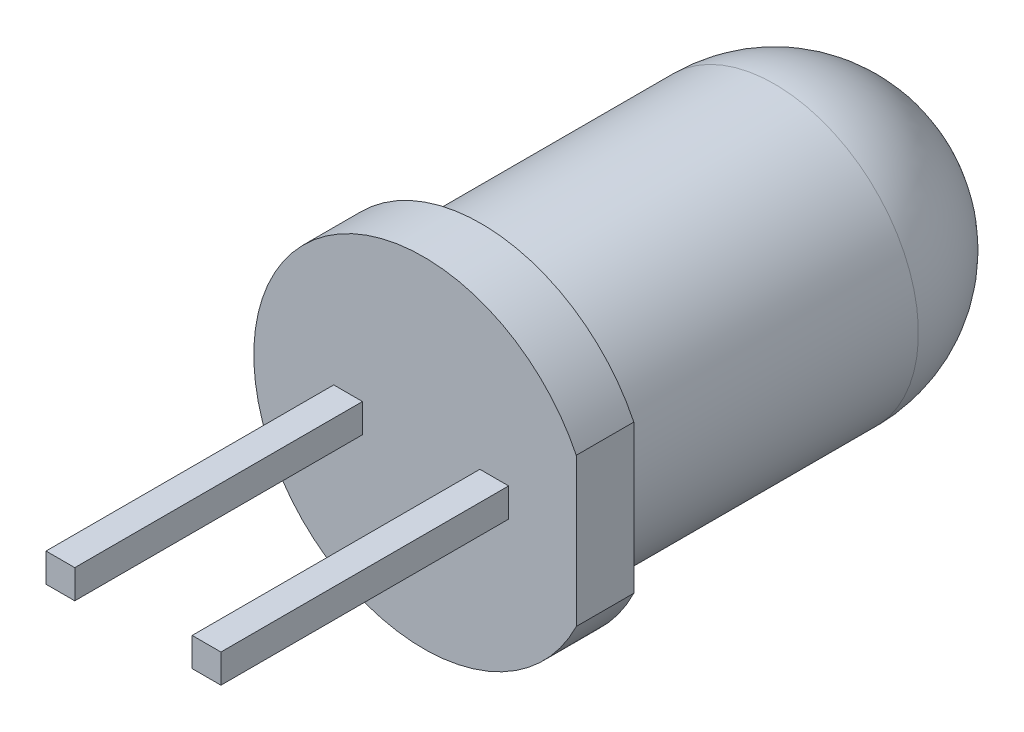
ISO-10303-21;
HEADER;
FILE_DESCRIPTION(('STEP AP214'),'2;1');
FILE_NAME('part.step','',(''),(''),'','','');
FILE_SCHEMA(('AUTOMOTIVE_DESIGN { 1 0 10303 214 1 1 1 1 }'));
ENDSEC;
DATA;
#1=APPLICATION_CONTEXT('core data for automotive mechanical design processes');
#2=APPLICATION_PROTOCOL_DEFINITION('international standard','automotive_design',2000,#1);
#3=PRODUCT_CONTEXT('',#1,'mechanical');
#4=PRODUCT('Part','Part','',(#3));
#5=PRODUCT_RELATED_PRODUCT_CATEGORY('part','',(#4));
#6=PRODUCT_DEFINITION_FORMATION('','',#4);
#7=PRODUCT_DEFINITION_CONTEXT('part definition',#1,'design');
#8=PRODUCT_DEFINITION('design','',#6,#7);
#9=PRODUCT_DEFINITION_SHAPE('','',#8);
#10=(LENGTH_UNIT() NAMED_UNIT(*) SI_UNIT(.MILLI.,.METRE.));
#11=(NAMED_UNIT(*) PLANE_ANGLE_UNIT() SI_UNIT($,.RADIAN.));
#12=(NAMED_UNIT(*) SI_UNIT($,.STERADIAN.) SOLID_ANGLE_UNIT());
#13=UNCERTAINTY_MEASURE_WITH_UNIT(LENGTH_MEASURE(1.E-05),#10,'distance_accuracy_value','');
#14=(GEOMETRIC_REPRESENTATION_CONTEXT(3) GLOBAL_UNCERTAINTY_ASSIGNED_CONTEXT((#13)) GLOBAL_UNIT_ASSIGNED_CONTEXT((#10,
#11,#12)) REPRESENTATION_CONTEXT('',''));
#15=CARTESIAN_POINT('',(0.,0.,0.));
#16=DIRECTION('',(0.,0.,1.));
#17=DIRECTION('',(1.,0.,0.));
#18=AXIS2_PLACEMENT_3D('',#15,#16,#17);
#19=CARTESIAN_POINT('',(0.,0.,1.31875));
#20=DIRECTION('',(0.,0.,-1.));
#21=DIRECTION('',(-1.,0.,0.));
#22=AXIS2_PLACEMENT_3D('',#19,#20,#21);
#23=PLANE('',#22);
#24=DIRECTION('',(0.,1.,0.));
#25=VECTOR('',#24,1.);
#26=CARTESIAN_POINT('',(-1.02,0.23975046998291,1.31875));
#27=LINE('',#26,#25);
#28=CARTESIAN_POINT('',(-1.02,-0.26024953001709,1.31875));
#29=VERTEX_POINT('',#28);
#30=CARTESIAN_POINT('',(-1.02,0.23975046998291,1.31875));
#31=VERTEX_POINT('',#30);
#32=EDGE_CURVE('E381',#29,#31,#27,.T.);
#33=ORIENTED_EDGE('',*,*,#32,.F.);
#34=DIRECTION('',(1.,0.,0.));
#35=VECTOR('',#34,1.);
#36=CARTESIAN_POINT('',(-1.02,-0.26024953001709,1.31875));
#37=LINE('',#36,#35);
#38=CARTESIAN_POINT('',(-1.52,-0.26024953001709,1.31875));
#39=VERTEX_POINT('',#38);
#40=EDGE_CURVE('E400',#39,#29,#37,.T.);
#41=ORIENTED_EDGE('',*,*,#40,.F.);
#42=DIRECTION('',(0.,-1.,0.));
#43=VECTOR('',#42,1.);
#44=CARTESIAN_POINT('',(-1.52,0.23975046998291,1.31875));
#45=LINE('',#44,#43);
#46=CARTESIAN_POINT('',(-1.52,0.23975046998291,1.31875));
#47=VERTEX_POINT('',#46);
#48=EDGE_CURVE('E390',#47,#39,#45,.T.);
#49=ORIENTED_EDGE('',*,*,#48,.F.);
#50=DIRECTION('',(-1.,0.,0.));
#51=VECTOR('',#50,1.);
#52=CARTESIAN_POINT('',(-1.02,0.23975046998291,1.31875));
#53=LINE('',#52,#51);
#54=EDGE_CURVE('E386',#31,#47,#53,.T.);
#55=ORIENTED_EDGE('',*,*,#54,.F.);
#56=EDGE_LOOP('',(#33,#41,#49,#55));
#57=FACE_BOUND('',#56,.T.);
#58=CARTESIAN_POINT('',(0.0414244186046485,0.,1.31875));
#59=DIRECTION('',(0.,0.,-1.));
#60=DIRECTION('',(-1.,0.,0.));
#61=AXIS2_PLACEMENT_3D('',#58,#59,#60);
#62=CIRCLE('',#61,2.95);
#63=CARTESIAN_POINT('',(2.6952937472328,-1.28820712098899,1.31875));
#64=VERTEX_POINT('',#63);
#65=CARTESIAN_POINT('',(2.6952937472328,1.28820712098899,1.31875));
#66=VERTEX_POINT('',#65);
#67=EDGE_CURVE('E141',#64,#66,#62,.T.);
#68=ORIENTED_EDGE('',*,*,#67,.F.);
#69=DIRECTION('',(0.,-1.,0.));
#70=VECTOR('',#69,1.);
#71=CARTESIAN_POINT('',(2.6952937472328,2.19268033882688,1.31875));
#72=LINE('',#71,#70);
#73=EDGE_CURVE('E66',#66,#64,#72,.T.);
#74=ORIENTED_EDGE('',*,*,#73,.F.);
#75=EDGE_LOOP('',(#68,#74));
#76=FACE_BOUND('',#75,.T.);
#77=DIRECTION('',(0.,1.,0.));
#78=VECTOR('',#77,1.);
#79=CARTESIAN_POINT('',(1.52,0.23975046998291,1.31875));
#80=LINE('',#79,#78);
#81=CARTESIAN_POINT('',(1.52,-0.26024953001709,1.31875));
#82=VERTEX_POINT('',#81);
#83=CARTESIAN_POINT('',(1.52,0.23975046998291,1.31875));
#84=VERTEX_POINT('',#83);
#85=EDGE_CURVE('E134',#82,#84,#80,.T.);
#86=ORIENTED_EDGE('',*,*,#85,.F.);
#87=DIRECTION('',(1.,0.,0.));
#88=VECTOR('',#87,1.);
#89=CARTESIAN_POINT('',(1.52,-0.26024953001709,1.31875));
#90=LINE('',#89,#88);
#91=CARTESIAN_POINT('',(1.02,-0.26024953001709,1.31875));
#92=VERTEX_POINT('',#91);
#93=EDGE_CURVE('E427',#92,#82,#90,.T.);
#94=ORIENTED_EDGE('',*,*,#93,.F.);
#95=DIRECTION('',(0.,-1.,0.));
#96=VECTOR('',#95,1.);
#97=CARTESIAN_POINT('',(1.02,0.23975046998291,1.31875));
#98=LINE('',#97,#96);
#99=CARTESIAN_POINT('',(1.02,0.23975046998291,1.31875));
#100=VERTEX_POINT('',#99);
#101=EDGE_CURVE('E431',#100,#92,#98,.T.);
#102=ORIENTED_EDGE('',*,*,#101,.F.);
#103=DIRECTION('',(-1.,0.,0.));
#104=VECTOR('',#103,1.);
#105=CARTESIAN_POINT('',(1.52,0.23975046998291,1.31875));
#106=LINE('',#105,#104);
#107=EDGE_CURVE('E74',#84,#100,#106,.T.);
#108=ORIENTED_EDGE('',*,*,#107,.F.);
#109=EDGE_LOOP('',(#86,#94,#102,#108));
#110=FACE_BOUND('',#109,.T.);
#111=ADVANCED_FACE('F50',(#57,#76,#110),#23,.F.);
#112=CARTESIAN_POINT('',(0.0414244186046476,0.,-4.78125));
#113=DIRECTION('',(0.,0.,-1.));
#114=DIRECTION('',(-1.,0.,0.));
#115=AXIS2_PLACEMENT_3D('',#112,#113,#114);
#116=SPHERICAL_SURFACE('',#115,2.5);
#117=CARTESIAN_POINT('',(0.0414244186046476,0.,-4.78125));
#118=DIRECTION('',(0.,0.,-1.));
#119=DIRECTION('',(-1.,0.,0.));
#120=AXIS2_PLACEMENT_3D('',#117,#118,#119);
#121=CIRCLE('',#120,2.5);
#122=CARTESIAN_POINT('',(-2.45857558139535,0.,-4.78125));
#123=VERTEX_POINT('',#122);
#124=EDGE_CURVE('E147',#123,#123,#121,.T.);
#125=ORIENTED_EDGE('',*,*,#124,.T.);
#126=EDGE_LOOP('',(#125));
#127=FACE_BOUND('',#126,.T.);
#128=ADVANCED_FACE('F208',(#127),#116,.T.);
#129=CARTESIAN_POINT('',(0.0414244186046472,0.,-7.28125));
#130=DIRECTION('',(0.,0.,-1.));
#131=DIRECTION('',(-1.,0.,0.));
#132=AXIS2_PLACEMENT_3D('',#129,#130,#131);
#133=CYLINDRICAL_SURFACE('',#132,2.5);
#134=ORIENTED_EDGE('',*,*,#124,.F.);
#135=EDGE_LOOP('',(#134));
#136=FACE_BOUND('',#135,.T.);
#137=CARTESIAN_POINT('',(0.0414244186046483,0.,0.31875));
#138=DIRECTION('',(0.,0.,-1.));
#139=DIRECTION('',(-1.,0.,0.));
#140=AXIS2_PLACEMENT_3D('',#137,#138,#139);
#141=CIRCLE('',#140,2.5);
#142=CARTESIAN_POINT('',(-2.45857558139535,0.,0.31875));
#143=VERTEX_POINT('',#142);
#144=EDGE_CURVE('E144',#143,#143,#141,.T.);
#145=ORIENTED_EDGE('',*,*,#144,.T.);
#146=EDGE_LOOP('',(#145));
#147=FACE_BOUND('',#146,.T.);
#148=ADVANCED_FACE('F215',(#136,#147),#133,.T.);
#149=CARTESIAN_POINT('',(0.,0.,0.318749999999999));
#150=DIRECTION('',(0.,0.,1.));
#151=DIRECTION('',(1.,0.,0.));
#152=AXIS2_PLACEMENT_3D('',#149,#150,#151);
#153=PLANE('',#152);
#154=ORIENTED_EDGE('',*,*,#144,.F.);
#155=EDGE_LOOP('',(#154));
#156=FACE_BOUND('',#155,.T.);
#157=CARTESIAN_POINT('',(0.0414244186046483,0.,0.318749999999999));
#158=DIRECTION('',(0.,0.,-1.));
#159=DIRECTION('',(-1.,0.,0.));
#160=AXIS2_PLACEMENT_3D('',#157,#158,#159);
#161=CIRCLE('',#160,2.95);
#162=CARTESIAN_POINT('',(2.69529374723281,-1.28820712098899,0.318749999999998));
#163=VERTEX_POINT('',#162);
#164=CARTESIAN_POINT('',(2.69529374723281,1.28820712098899,0.318749999999998));
#165=VERTEX_POINT('',#164);
#166=EDGE_CURVE('E139',#163,#165,#161,.T.);
#167=ORIENTED_EDGE('',*,*,#166,.T.);
#168=DIRECTION('',(0.,1.,0.));
#169=VECTOR('',#168,1.);
#170=CARTESIAN_POINT('',(2.6952937472328,2.19268033882688,0.318749999999999));
#171=LINE('',#170,#169);
#172=EDGE_CURVE('E126',#163,#165,#171,.T.);
#173=ORIENTED_EDGE('',*,*,#172,.F.);
#174=EDGE_LOOP('',(#167,#173));
#175=FACE_BOUND('',#174,.T.);
#176=ADVANCED_FACE('F143',(#156,#175),#153,.F.);
#177=CARTESIAN_POINT('',(0.0414244186046472,0.,-7.28125));
#178=DIRECTION('',(0.,0.,-1.));
#179=DIRECTION('',(-1.,0.,0.));
#180=AXIS2_PLACEMENT_3D('',#177,#178,#179);
#181=CYLINDRICAL_SURFACE('',#180,2.95);
#182=ORIENTED_EDGE('',*,*,#67,.T.);
#183=DIRECTION('',(0.,0.,-1.));
#184=VECTOR('',#183,1.);
#185=CARTESIAN_POINT('',(2.6952937472328,1.28820712098899,-7.28125));
#186=LINE('',#185,#184);
#187=EDGE_CURVE('E129',#165,#66,#186,.F.);
#188=ORIENTED_EDGE('',*,*,#187,.F.);
#189=ORIENTED_EDGE('',*,*,#166,.F.);
#190=DIRECTION('',(0.,0.,-1.));
#191=VECTOR('',#190,1.);
#192=CARTESIAN_POINT('',(2.6952937472328,-1.28820712098899,-7.28125));
#193=LINE('',#192,#191);
#194=EDGE_CURVE('E130',#64,#163,#193,.T.);
#195=ORIENTED_EDGE('',*,*,#194,.F.);
#196=EDGE_LOOP('',(#182,#188,#189,#195));
#197=FACE_BOUND('',#196,.T.);
#198=ADVANCED_FACE('F138',(#197),#181,.T.);
#199=CARTESIAN_POINT('',(-1.02,0.23975046998291,6.31875));
#200=DIRECTION('',(-1.,0.,0.));
#201=DIRECTION('',(0.,0.,1.));
#202=AXIS2_PLACEMENT_3D('',#199,#200,#201);
#203=PLANE('',#202);
#204=ORIENTED_EDGE('',*,*,#32,.T.);
#205=DIRECTION('',(0.,0.,-1.));
#206=VECTOR('',#205,1.);
#207=CARTESIAN_POINT('',(-1.02,0.23975046998291,6.31875));
#208=LINE('',#207,#206);
#209=CARTESIAN_POINT('',(-1.02,0.23975046998291,6.31875));
#210=VERTEX_POINT('',#209);
#211=EDGE_CURVE('E185',#210,#31,#208,.T.);
#212=ORIENTED_EDGE('',*,*,#211,.F.);
#213=DIRECTION('',(0.,1.,0.));
#214=VECTOR('',#213,1.);
#215=CARTESIAN_POINT('',(-1.02,0.23975046998291,6.31875));
#216=LINE('',#215,#214);
#217=CARTESIAN_POINT('',(-1.02,-0.26024953001709,6.31875));
#218=VERTEX_POINT('',#217);
#219=EDGE_CURVE('E402',#218,#210,#216,.T.);
#220=ORIENTED_EDGE('',*,*,#219,.F.);
#221=DIRECTION('',(0.,0.,-1.));
#222=VECTOR('',#221,1.);
#223=CARTESIAN_POINT('',(-1.02,-0.26024953001709,6.31875));
#224=LINE('',#223,#222);
#225=EDGE_CURVE('E384',#218,#29,#224,.T.);
#226=ORIENTED_EDGE('',*,*,#225,.T.);
#227=EDGE_LOOP('',(#204,#212,#220,#226));
#228=FACE_BOUND('',#227,.T.);
#229=ADVANCED_FACE('F212',(#228),#203,.F.);
#230=CARTESIAN_POINT('',(-1.02,0.23975046998291,6.31875));
#231=DIRECTION('',(0.,-1.,0.));
#232=DIRECTION('',(0.,0.,-1.));
#233=AXIS2_PLACEMENT_3D('',#230,#231,#232);
#234=PLANE('',#233);
#235=ORIENTED_EDGE('',*,*,#54,.T.);
#236=DIRECTION('',(0.,0.,-1.));
#237=VECTOR('',#236,1.);
#238=CARTESIAN_POINT('',(-1.52,0.23975046998291,6.31875));
#239=LINE('',#238,#237);
#240=CARTESIAN_POINT('',(-1.52,0.23975046998291,6.31875));
#241=VERTEX_POINT('',#240);
#242=EDGE_CURVE('E190',#241,#47,#239,.T.);
#243=ORIENTED_EDGE('',*,*,#242,.F.);
#244=DIRECTION('',(-1.,0.,0.));
#245=VECTOR('',#244,1.);
#246=CARTESIAN_POINT('',(-1.02,0.23975046998291,6.31875));
#247=LINE('',#246,#245);
#248=EDGE_CURVE('E411',#210,#241,#247,.T.);
#249=ORIENTED_EDGE('',*,*,#248,.F.);
#250=ORIENTED_EDGE('',*,*,#211,.T.);
#251=EDGE_LOOP('',(#235,#243,#249,#250));
#252=FACE_BOUND('',#251,.T.);
#253=ADVANCED_FACE('F363',(#252),#234,.F.);
#254=CARTESIAN_POINT('',(-1.52,0.23975046998291,6.31875));
#255=DIRECTION('',(1.,0.,0.));
#256=DIRECTION('',(0.,0.,-1.));
#257=AXIS2_PLACEMENT_3D('',#254,#255,#256);
#258=PLANE('',#257);
#259=ORIENTED_EDGE('',*,*,#48,.T.);
#260=DIRECTION('',(0.,0.,-1.));
#261=VECTOR('',#260,1.);
#262=CARTESIAN_POINT('',(-1.52,-0.26024953001709,6.31875));
#263=LINE('',#262,#261);
#264=CARTESIAN_POINT('',(-1.52,-0.26024953001709,6.31875));
#265=VERTEX_POINT('',#264);
#266=EDGE_CURVE('E404',#265,#39,#263,.T.);
#267=ORIENTED_EDGE('',*,*,#266,.F.);
#268=DIRECTION('',(0.,-1.,0.));
#269=VECTOR('',#268,1.);
#270=CARTESIAN_POINT('',(-1.52,0.23975046998291,6.31875));
#271=LINE('',#270,#269);
#272=EDGE_CURVE('E410',#241,#265,#271,.T.);
#273=ORIENTED_EDGE('',*,*,#272,.F.);
#274=ORIENTED_EDGE('',*,*,#242,.T.);
#275=EDGE_LOOP('',(#259,#267,#273,#274));
#276=FACE_BOUND('',#275,.T.);
#277=ADVANCED_FACE('F355',(#276),#258,.F.);
#278=CARTESIAN_POINT('',(-1.02,-0.26024953001709,6.31875));
#279=DIRECTION('',(0.,1.,0.));
#280=DIRECTION('',(0.,0.,1.));
#281=AXIS2_PLACEMENT_3D('',#278,#279,#280);
#282=PLANE('',#281);
#283=ORIENTED_EDGE('',*,*,#40,.T.);
#284=ORIENTED_EDGE('',*,*,#225,.F.);
#285=DIRECTION('',(1.,0.,0.));
#286=VECTOR('',#285,1.);
#287=CARTESIAN_POINT('',(-1.02,-0.26024953001709,6.31875));
#288=LINE('',#287,#286);
#289=EDGE_CURVE('E395',#265,#218,#288,.T.);
#290=ORIENTED_EDGE('',*,*,#289,.F.);
#291=ORIENTED_EDGE('',*,*,#266,.T.);
#292=EDGE_LOOP('',(#283,#284,#290,#291));
#293=FACE_BOUND('',#292,.T.);
#294=ADVANCED_FACE('F347',(#293),#282,.F.);
#295=CARTESIAN_POINT('',(0.,0.,6.31875));
#296=DIRECTION('',(0.,0.,-1.));
#297=DIRECTION('',(-1.,0.,0.));
#298=AXIS2_PLACEMENT_3D('',#295,#296,#297);
#299=PLANE('',#298);
#300=ORIENTED_EDGE('',*,*,#219,.T.);
#301=ORIENTED_EDGE('',*,*,#248,.T.);
#302=ORIENTED_EDGE('',*,*,#272,.T.);
#303=ORIENTED_EDGE('',*,*,#289,.T.);
#304=EDGE_LOOP('',(#300,#301,#302,#303));
#305=FACE_BOUND('',#304,.T.);
#306=ADVANCED_FACE('F339',(#305),#299,.F.);
#307=CARTESIAN_POINT('',(1.52,0.23975046998291,6.31875));
#308=DIRECTION('',(-1.,0.,0.));
#309=DIRECTION('',(0.,0.,1.));
#310=AXIS2_PLACEMENT_3D('',#307,#308,#309);
#311=PLANE('',#310);
#312=ORIENTED_EDGE('',*,*,#85,.T.);
#313=DIRECTION('',(0.,0.,-1.));
#314=VECTOR('',#313,1.);
#315=CARTESIAN_POINT('',(1.52,0.23975046998291,6.31875));
#316=LINE('',#315,#314);
#317=CARTESIAN_POINT('',(1.52,0.23975046998291,6.31875));
#318=VERTEX_POINT('',#317);
#319=EDGE_CURVE('E387',#318,#84,#316,.T.);
#320=ORIENTED_EDGE('',*,*,#319,.F.);
#321=DIRECTION('',(0.,1.,0.));
#322=VECTOR('',#321,1.);
#323=CARTESIAN_POINT('',(1.52,0.23975046998291,6.31875));
#324=LINE('',#323,#322);
#325=CARTESIAN_POINT('',(1.52,-0.26024953001709,6.31875));
#326=VERTEX_POINT('',#325);
#327=EDGE_CURVE('E430',#326,#318,#324,.T.);
#328=ORIENTED_EDGE('',*,*,#327,.F.);
#329=DIRECTION('',(0.,0.,-1.));
#330=VECTOR('',#329,1.);
#331=CARTESIAN_POINT('',(1.52,-0.26024953001709,6.31875));
#332=LINE('',#331,#330);
#333=EDGE_CURVE('E423',#326,#82,#332,.T.);
#334=ORIENTED_EDGE('',*,*,#333,.T.);
#335=EDGE_LOOP('',(#312,#320,#328,#334));
#336=FACE_BOUND('',#335,.T.);
#337=ADVANCED_FACE('F331',(#336),#311,.F.);
#338=CARTESIAN_POINT('',(1.52,0.23975046998291,6.31875));
#339=DIRECTION('',(0.,-1.,0.));
#340=DIRECTION('',(0.,0.,-1.));
#341=AXIS2_PLACEMENT_3D('',#338,#339,#340);
#342=PLANE('',#341);
#343=ORIENTED_EDGE('',*,*,#107,.T.);
#344=DIRECTION('',(0.,0.,-1.));
#345=VECTOR('',#344,1.);
#346=CARTESIAN_POINT('',(1.02,0.23975046998291,6.31875));
#347=LINE('',#346,#345);
#348=CARTESIAN_POINT('',(1.02,0.23975046998291,6.31875));
#349=VERTEX_POINT('',#348);
#350=EDGE_CURVE('E392',#349,#100,#347,.T.);
#351=ORIENTED_EDGE('',*,*,#350,.F.);
#352=DIRECTION('',(-1.,0.,0.));
#353=VECTOR('',#352,1.);
#354=CARTESIAN_POINT('',(1.52,0.23975046998291,6.31875));
#355=LINE('',#354,#353);
#356=EDGE_CURVE('E440',#318,#349,#355,.T.);
#357=ORIENTED_EDGE('',*,*,#356,.F.);
#358=ORIENTED_EDGE('',*,*,#319,.T.);
#359=EDGE_LOOP('',(#343,#351,#357,#358));
#360=FACE_BOUND('',#359,.T.);
#361=ADVANCED_FACE('F323',(#360),#342,.F.);
#362=CARTESIAN_POINT('',(1.02,0.23975046998291,6.31875));
#363=DIRECTION('',(1.,0.,0.));
#364=DIRECTION('',(0.,0.,-1.));
#365=AXIS2_PLACEMENT_3D('',#362,#363,#364);
#366=PLANE('',#365);
#367=ORIENTED_EDGE('',*,*,#101,.T.);
#368=DIRECTION('',(0.,0.,-1.));
#369=VECTOR('',#368,1.);
#370=CARTESIAN_POINT('',(1.02,-0.26024953001709,6.31875));
#371=LINE('',#370,#369);
#372=CARTESIAN_POINT('',(1.02,-0.26024953001709,6.31875));
#373=VERTEX_POINT('',#372);
#374=EDGE_CURVE('E420',#373,#92,#371,.T.);
#375=ORIENTED_EDGE('',*,*,#374,.F.);
#376=DIRECTION('',(0.,-1.,0.));
#377=VECTOR('',#376,1.);
#378=CARTESIAN_POINT('',(1.02,0.23975046998291,6.31875));
#379=LINE('',#378,#377);
#380=EDGE_CURVE('E438',#349,#373,#379,.T.);
#381=ORIENTED_EDGE('',*,*,#380,.F.);
#382=ORIENTED_EDGE('',*,*,#350,.T.);
#383=EDGE_LOOP('',(#367,#375,#381,#382));
#384=FACE_BOUND('',#383,.T.);
#385=ADVANCED_FACE('F315',(#384),#366,.F.);
#386=CARTESIAN_POINT('',(1.52,-0.26024953001709,6.31875));
#387=DIRECTION('',(0.,1.,0.));
#388=DIRECTION('',(0.,0.,1.));
#389=AXIS2_PLACEMENT_3D('',#386,#387,#388);
#390=PLANE('',#389);
#391=ORIENTED_EDGE('',*,*,#93,.T.);
#392=ORIENTED_EDGE('',*,*,#333,.F.);
#393=DIRECTION('',(1.,0.,0.));
#394=VECTOR('',#393,1.);
#395=CARTESIAN_POINT('',(1.52,-0.26024953001709,6.31875));
#396=LINE('',#395,#394);
#397=EDGE_CURVE('E426',#373,#326,#396,.T.);
#398=ORIENTED_EDGE('',*,*,#397,.F.);
#399=ORIENTED_EDGE('',*,*,#374,.T.);
#400=EDGE_LOOP('',(#391,#392,#398,#399));
#401=FACE_BOUND('',#400,.T.);
#402=ADVANCED_FACE('F306',(#401),#390,.F.);
#403=CARTESIAN_POINT('',(0.,0.,6.31875));
#404=DIRECTION('',(0.,0.,-1.));
#405=DIRECTION('',(-1.,0.,0.));
#406=AXIS2_PLACEMENT_3D('',#403,#404,#405);
#407=PLANE('',#406);
#408=ORIENTED_EDGE('',*,*,#327,.T.);
#409=ORIENTED_EDGE('',*,*,#356,.T.);
#410=ORIENTED_EDGE('',*,*,#380,.T.);
#411=ORIENTED_EDGE('',*,*,#397,.T.);
#412=EDGE_LOOP('',(#408,#409,#410,#411));
#413=FACE_BOUND('',#412,.T.);
#414=ADVANCED_FACE('F244',(#413),#407,.F.);
#415=CARTESIAN_POINT('',(2.6952937472328,2.19268033882688,-7.28225));
#416=DIRECTION('',(-1.,0.,0.));
#417=DIRECTION('',(0.,0.,1.));
#418=AXIS2_PLACEMENT_3D('',#415,#416,#417);
#419=PLANE('',#418);
#420=ORIENTED_EDGE('',*,*,#187,.T.);
#421=ORIENTED_EDGE('',*,*,#73,.T.);
#422=ORIENTED_EDGE('',*,*,#194,.T.);
#423=ORIENTED_EDGE('',*,*,#172,.T.);
#424=EDGE_LOOP('',(#420,#421,#422,#423));
#425=FACE_BOUND('',#424,.T.);
#426=ADVANCED_FACE('F128',(#425),#419,.F.);
#427=CLOSED_SHELL('',(#111,#128,#148,#176,#198,#229,#253,#277,#294,#306,#337,#361,#385,#402,
#414,#426));
#428=CARTESIAN_POINT('',(0.0414244186046472,0.,-7.28125));
#429=DIRECTION('',(0.,0.,-1.));
#430=DIRECTION('',(-1.,0.,0.));
#431=AXIS2_PLACEMENT_3D('',#428,#429,#430);
#432=CYLINDRICAL_SURFACE('',#431,2.2);
#433=CARTESIAN_POINT('',(0.0414244186046476,0.,-4.78125));
#434=DIRECTION('',(0.,0.,-1.));
#435=DIRECTION('',(-1.,0.,0.));
#436=AXIS2_PLACEMENT_3D('',#433,#434,#435);
#437=CIRCLE('',#436,2.2);
#438=CARTESIAN_POINT('',(-2.15857558139535,0.,-4.78125));
#439=VERTEX_POINT('',#438);
#440=EDGE_CURVE('E11',#439,#439,#437,.T.);
#441=ORIENTED_EDGE('',*,*,#440,.T.);
#442=EDGE_LOOP('',(#441));
#443=FACE_BOUND('',#442,.T.);
#444=CARTESIAN_POINT('',(0.0414244186046484,0.,0.618749999999999));
#445=DIRECTION('',(0.,0.,-1.));
#446=DIRECTION('',(-1.,0.,0.));
#447=AXIS2_PLACEMENT_3D('',#444,#445,#446);
#448=CIRCLE('',#447,2.2);
#449=CARTESIAN_POINT('',(-2.15857558139535,0.,0.61875));
#450=VERTEX_POINT('',#449);
#451=EDGE_CURVE('E182',#450,#450,#448,.T.);
#452=ORIENTED_EDGE('',*,*,#451,.F.);
#453=EDGE_LOOP('',(#452));
#454=FACE_BOUND('',#453,.T.);
#455=ADVANCED_FACE('F52',(#443,#454),#432,.F.);
#456=CARTESIAN_POINT('',(0.0414244186046476,0.,-4.78125));
#457=DIRECTION('',(0.,0.,-1.));
#458=DIRECTION('',(-1.,0.,0.));
#459=AXIS2_PLACEMENT_3D('',#456,#457,#458);
#460=SPHERICAL_SURFACE('',#459,2.2);
#461=CARTESIAN_POINT('',(0.0414244186046473,0.,-6.96069947177034));
#462=DIRECTION('',(0.,0.,-1.));
#463=DIRECTION('',(-1.,0.,0.));
#464=AXIS2_PLACEMENT_3D('',#461,#462,#463);
#465=CIRCLE('',#464,0.3);
#466=CARTESIAN_POINT('',(-0.258575581395352,0.,-6.96069947177034));
#467=VERTEX_POINT('',#466);
#468=EDGE_CURVE('E59',#467,#467,#465,.T.);
#469=ORIENTED_EDGE('',*,*,#468,.T.);
#470=EDGE_LOOP('',(#469));
#471=FACE_BOUND('',#470,.T.);
#472=ORIENTED_EDGE('',*,*,#440,.F.);
#473=EDGE_LOOP('',(#472));
#474=FACE_BOUND('',#473,.T.);
#475=ADVANCED_FACE('F157',(#471,#474),#460,.F.);
#476=CARTESIAN_POINT('',(0.,0.,-6.96069947177034));
#477=DIRECTION('',(0.,0.,1.));
#478=DIRECTION('',(1.,0.,0.));
#479=AXIS2_PLACEMENT_3D('',#476,#477,#478);
#480=PLANE('',#479);
#481=ORIENTED_EDGE('',*,*,#468,.F.);
#482=EDGE_LOOP('',(#481));
#483=FACE_BOUND('',#482,.T.);
#484=ADVANCED_FACE('F160',(#483),#480,.T.);
#485=CARTESIAN_POINT('',(0.,0.,1.01875));
#486=DIRECTION('',(0.,0.,1.));
#487=DIRECTION('',(1.,0.,0.));
#488=AXIS2_PLACEMENT_3D('',#485,#486,#487);
#489=PLANE('',#488);
#490=CARTESIAN_POINT('',(0.0414244186046485,0.,1.01875));
#491=DIRECTION('',(0.,0.,-1.));
#492=DIRECTION('',(-1.,0.,0.));
#493=AXIS2_PLACEMENT_3D('',#490,#491,#492);
#494=CIRCLE('',#493,2.65);
#495=CARTESIAN_POINT('',(-2.60857558139535,0.,1.01875));
#496=VERTEX_POINT('',#495);
#497=EDGE_CURVE('E149',#496,#496,#494,.T.);
#498=ORIENTED_EDGE('',*,*,#497,.T.);
#499=EDGE_LOOP('',(#498));
#500=FACE_BOUND('',#499,.T.);
#501=ADVANCED_FACE('F162',(#500),#489,.F.);
#502=CARTESIAN_POINT('',(0.0414244186046472,0.,-7.28125));
#503=DIRECTION('',(0.,0.,-1.));
#504=DIRECTION('',(-1.,0.,0.));
#505=AXIS2_PLACEMENT_3D('',#502,#503,#504);
#506=CYLINDRICAL_SURFACE('',#505,2.65);
#507=CARTESIAN_POINT('',(0.0414244186046484,0.,0.618749999999999));
#508=DIRECTION('',(0.,0.,-1.));
#509=DIRECTION('',(-1.,0.,0.));
#510=AXIS2_PLACEMENT_3D('',#507,#508,#509);
#511=CIRCLE('',#510,2.65);
#512=CARTESIAN_POINT('',(-2.60857558139535,0.,0.61875));
#513=VERTEX_POINT('',#512);
#514=EDGE_CURVE('E184',#513,#513,#511,.T.);
#515=ORIENTED_EDGE('',*,*,#514,.T.);
#516=EDGE_LOOP('',(#515));
#517=FACE_BOUND('',#516,.T.);
#518=ORIENTED_EDGE('',*,*,#497,.F.);
#519=EDGE_LOOP('',(#518));
#520=FACE_BOUND('',#519,.T.);
#521=ADVANCED_FACE('F169',(#517,#520),#506,.F.);
#522=CARTESIAN_POINT('',(0.,0.,0.618749999999999));
#523=DIRECTION('',(0.,0.,1.));
#524=DIRECTION('',(1.,0.,0.));
#525=AXIS2_PLACEMENT_3D('',#522,#523,#524);
#526=PLANE('',#525);
#527=ORIENTED_EDGE('',*,*,#451,.T.);
#528=EDGE_LOOP('',(#527));
#529=FACE_BOUND('',#528,.T.);
#530=ORIENTED_EDGE('',*,*,#514,.F.);
#531=EDGE_LOOP('',(#530));
#532=FACE_BOUND('',#531,.T.);
#533=ADVANCED_FACE('F197',(#529,#532),#526,.T.);
#534=CLOSED_SHELL('',(#455,#475,#484,#501,#521,#533));
#535=ORIENTED_CLOSED_SHELL('',*,#534,.T.);
#536=BREP_WITH_VOIDS('B2',#427,(#535));
#537=ADVANCED_BREP_SHAPE_REPRESENTATION('',(#18,#536),#14);
#538=SHAPE_DEFINITION_REPRESENTATION(#9,#537);
ENDSEC;
END-ISO-10303-21;
